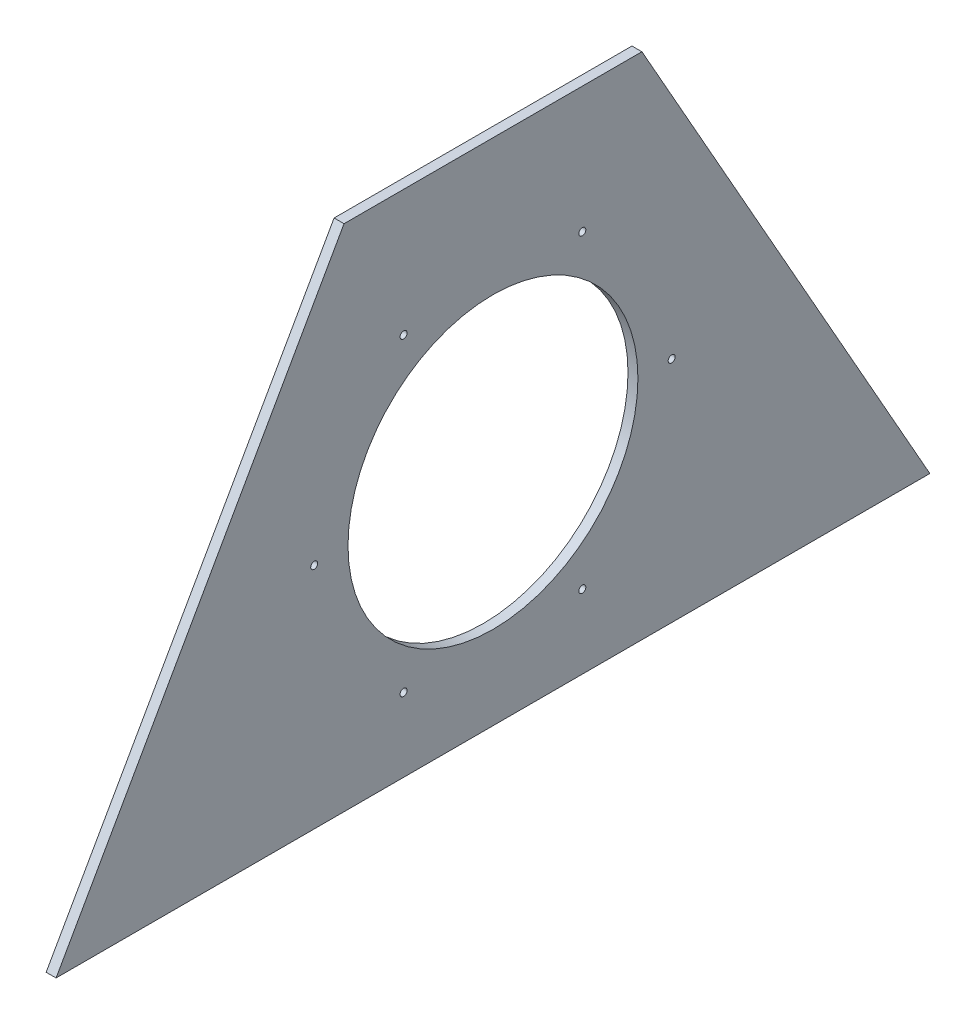
ISO-10303-21;
HEADER;
FILE_DESCRIPTION(('STEP AP214'),'2;1');
FILE_NAME('part.step','',(''),(''),'','','');
FILE_SCHEMA(('AUTOMOTIVE_DESIGN { 1 0 10303 214 1 1 1 1 }'));
ENDSEC;
DATA;
#1=APPLICATION_CONTEXT('core data for automotive mechanical design processes');
#2=APPLICATION_PROTOCOL_DEFINITION('international standard','automotive_design',2000,#1);
#3=PRODUCT_CONTEXT('',#1,'mechanical');
#4=PRODUCT('Part','Part','',(#3));
#5=PRODUCT_RELATED_PRODUCT_CATEGORY('part','',(#4));
#6=PRODUCT_DEFINITION_FORMATION('','',#4);
#7=PRODUCT_DEFINITION_CONTEXT('part definition',#1,'design');
#8=PRODUCT_DEFINITION('design','',#6,#7);
#9=PRODUCT_DEFINITION_SHAPE('','',#8);
#10=(LENGTH_UNIT() NAMED_UNIT(*) SI_UNIT(.MILLI.,.METRE.));
#11=(NAMED_UNIT(*) PLANE_ANGLE_UNIT() SI_UNIT($,.RADIAN.));
#12=(NAMED_UNIT(*) SI_UNIT($,.STERADIAN.) SOLID_ANGLE_UNIT());
#13=UNCERTAINTY_MEASURE_WITH_UNIT(LENGTH_MEASURE(1.E-05),#10,'distance_accuracy_value','');
#14=(GEOMETRIC_REPRESENTATION_CONTEXT(3) GLOBAL_UNCERTAINTY_ASSIGNED_CONTEXT((#13)) GLOBAL_UNIT_ASSIGNED_CONTEXT((#10,
#11,#12)) REPRESENTATION_CONTEXT('',''));
#15=CARTESIAN_POINT('',(0.,0.,0.));
#16=DIRECTION('',(0.,0.,1.));
#17=DIRECTION('',(1.,0.,0.));
#18=AXIS2_PLACEMENT_3D('',#15,#16,#17);
#19=CARTESIAN_POINT('',(6.35,0.,0.));
#20=DIRECTION('',(0.,-0.492192803801765,-0.870486211197947));
#21=DIRECTION('',(0.,0.870486211197947,-0.492192803801765));
#22=AXIS2_PLACEMENT_3D('',#19,#20,#21);
#23=PLANE('',#22);
#24=DIRECTION('',(0.,-0.870486211197947,0.492192803801765));
#25=VECTOR('',#24,1.);
#26=CARTESIAN_POINT('',(0.,0.,0.));
#27=LINE('',#26,#25);
#28=CARTESIAN_POINT('',(0.,325.685452030022,-184.15));
#29=VERTEX_POINT('',#28);
#30=CARTESIAN_POINT('',(0.,0.,0.));
#31=VERTEX_POINT('',#30);
#32=EDGE_CURVE('E98',#29,#31,#27,.T.);
#33=ORIENTED_EDGE('',*,*,#32,.T.);
#34=DIRECTION('',(-1.,0.,0.));
#35=VECTOR('',#34,1.);
#36=CARTESIAN_POINT('',(6.35,0.,0.));
#37=LINE('',#36,#35);
#38=CARTESIAN_POINT('',(6.35,0.,0.));
#39=VERTEX_POINT('',#38);
#40=EDGE_CURVE('E11',#39,#31,#37,.T.);
#41=ORIENTED_EDGE('',*,*,#40,.F.);
#42=DIRECTION('',(0.,-0.870486211197947,0.492192803801765));
#43=VECTOR('',#42,1.);
#44=CARTESIAN_POINT('',(6.35,0.,0.));
#45=LINE('',#44,#43);
#46=CARTESIAN_POINT('',(6.35,325.685452030022,-184.15));
#47=VERTEX_POINT('',#46);
#48=EDGE_CURVE('E85',#47,#39,#45,.T.);
#49=ORIENTED_EDGE('',*,*,#48,.F.);
#50=DIRECTION('',(-1.,0.,0.));
#51=VECTOR('',#50,1.);
#52=CARTESIAN_POINT('',(6.35,325.685452030022,-184.15));
#53=LINE('',#52,#51);
#54=EDGE_CURVE('E94',#47,#29,#53,.T.);
#55=ORIENTED_EDGE('',*,*,#54,.T.);
#56=EDGE_LOOP('',(#33,#41,#49,#55));
#57=FACE_BOUND('',#56,.T.);
#58=ADVANCED_FACE('F33',(#57),#23,.F.);
#59=CARTESIAN_POINT('',(6.35,0.,0.));
#60=DIRECTION('',(0.,1.,0.));
#61=DIRECTION('',(0.,0.,1.));
#62=AXIS2_PLACEMENT_3D('',#59,#60,#61);
#63=PLANE('',#62);
#64=DIRECTION('',(0.,0.,-1.));
#65=VECTOR('',#64,1.);
#66=CARTESIAN_POINT('',(0.,0.,0.));
#67=LINE('',#66,#65);
#68=CARTESIAN_POINT('',(0.,0.,-558.8));
#69=VERTEX_POINT('',#68);
#70=EDGE_CURVE('E89',#31,#69,#67,.T.);
#71=ORIENTED_EDGE('',*,*,#70,.T.);
#72=DIRECTION('',(-1.,0.,0.));
#73=VECTOR('',#72,1.);
#74=CARTESIAN_POINT('',(6.35,0.,-558.8));
#75=LINE('',#74,#73);
#76=CARTESIAN_POINT('',(6.35,0.,-558.8));
#77=VERTEX_POINT('',#76);
#78=EDGE_CURVE('E42',#77,#69,#75,.T.);
#79=ORIENTED_EDGE('',*,*,#78,.F.);
#80=DIRECTION('',(0.,0.,-1.));
#81=VECTOR('',#80,1.);
#82=CARTESIAN_POINT('',(6.35,0.,0.));
#83=LINE('',#82,#81);
#84=EDGE_CURVE('E80',#39,#77,#83,.T.);
#85=ORIENTED_EDGE('',*,*,#84,.F.);
#86=ORIENTED_EDGE('',*,*,#40,.T.);
#87=EDGE_LOOP('',(#71,#79,#85,#86));
#88=FACE_BOUND('',#87,.T.);
#89=ADVANCED_FACE('F88',(#88),#63,.F.);
#90=CARTESIAN_POINT('',(6.35,0.,-558.8));
#91=DIRECTION('',(0.,-0.492192803801765,0.870486211197947));
#92=DIRECTION('',(0.,-0.870486211197947,-0.492192803801765));
#93=AXIS2_PLACEMENT_3D('',#90,#91,#92);
#94=PLANE('',#93);
#95=DIRECTION('',(0.,0.870486211197947,0.492192803801765));
#96=VECTOR('',#95,1.);
#97=CARTESIAN_POINT('',(0.,0.,-558.8));
#98=LINE('',#97,#96);
#99=CARTESIAN_POINT('',(0.,325.685452030022,-374.65));
#100=VERTEX_POINT('',#99);
#101=EDGE_CURVE('E67',#69,#100,#98,.T.);
#102=ORIENTED_EDGE('',*,*,#101,.T.);
#103=DIRECTION('',(-1.,0.,0.));
#104=VECTOR('',#103,1.);
#105=CARTESIAN_POINT('',(6.35,325.685452030022,-374.65));
#106=LINE('',#105,#104);
#107=CARTESIAN_POINT('',(6.35,325.685452030022,-374.65));
#108=VERTEX_POINT('',#107);
#109=EDGE_CURVE('E90',#108,#100,#106,.T.);
#110=ORIENTED_EDGE('',*,*,#109,.F.);
#111=DIRECTION('',(0.,0.870486211197947,0.492192803801765));
#112=VECTOR('',#111,1.);
#113=CARTESIAN_POINT('',(6.35,0.,-558.8));
#114=LINE('',#113,#112);
#115=EDGE_CURVE('E83',#77,#108,#114,.T.);
#116=ORIENTED_EDGE('',*,*,#115,.F.);
#117=ORIENTED_EDGE('',*,*,#78,.T.);
#118=EDGE_LOOP('',(#102,#110,#116,#117));
#119=FACE_BOUND('',#118,.T.);
#120=ADVANCED_FACE('F92',(#119),#94,.F.);
#121=CARTESIAN_POINT('',(6.35,325.685452030022,-184.15));
#122=DIRECTION('',(0.,-1.,0.));
#123=DIRECTION('',(0.,0.,-1.));
#124=AXIS2_PLACEMENT_3D('',#121,#122,#123);
#125=PLANE('',#124);
#126=DIRECTION('',(0.,0.,1.));
#127=VECTOR('',#126,1.);
#128=CARTESIAN_POINT('',(0.,325.685452030022,-184.15));
#129=LINE('',#128,#127);
#130=EDGE_CURVE('E73',#100,#29,#129,.T.);
#131=ORIENTED_EDGE('',*,*,#130,.T.);
#132=ORIENTED_EDGE('',*,*,#54,.F.);
#133=DIRECTION('',(0.,0.,1.));
#134=VECTOR('',#133,1.);
#135=CARTESIAN_POINT('',(6.35,325.685452030022,-184.15));
#136=LINE('',#135,#134);
#137=EDGE_CURVE('E50',#108,#47,#136,.T.);
#138=ORIENTED_EDGE('',*,*,#137,.F.);
#139=ORIENTED_EDGE('',*,*,#109,.T.);
#140=EDGE_LOOP('',(#131,#132,#138,#139));
#141=FACE_BOUND('',#140,.T.);
#142=ADVANCED_FACE('F106',(#141),#125,.F.);
#143=CARTESIAN_POINT('',(6.35,0.,0.));
#144=DIRECTION('',(-1.,0.,0.));
#145=DIRECTION('',(0.,0.,1.));
#146=AXIS2_PLACEMENT_3D('',#143,#144,#145);
#147=PLANE('',#146);
#148=CARTESIAN_POINT('',(6.35,245.036703652561,-222.25));
#149=DIRECTION('',(-1.,0.,0.));
#150=DIRECTION('',(0.,0.,1.));
#151=AXIS2_PLACEMENT_3D('',#148,#149,#150);
#152=CIRCLE('',#151,2.2479);
#153=CARTESIAN_POINT('',(6.35,245.036703652561,-220.0021));
#154=VERTEX_POINT('',#153);
#155=EDGE_CURVE('E144',#154,#154,#152,.T.);
#156=ORIENTED_EDGE('',*,*,#155,.T.);
#157=EDGE_LOOP('',(#156));
#158=FACE_BOUND('',#157,.T.);
#159=CARTESIAN_POINT('',(6.35,146.05,-165.1));
#160=DIRECTION('',(-1.,0.,0.));
#161=DIRECTION('',(0.,0.,1.));
#162=AXIS2_PLACEMENT_3D('',#159,#160,#161);
#163=CIRCLE('',#162,2.2479);
#164=CARTESIAN_POINT('',(6.35,146.05,-162.8521));
#165=VERTEX_POINT('',#164);
#166=EDGE_CURVE('E138',#165,#165,#163,.T.);
#167=ORIENTED_EDGE('',*,*,#166,.T.);
#168=EDGE_LOOP('',(#167));
#169=FACE_BOUND('',#168,.T.);
#170=CARTESIAN_POINT('',(6.35,47.0632963474386,-222.25));
#171=DIRECTION('',(-1.,0.,0.));
#172=DIRECTION('',(0.,0.,1.));
#173=AXIS2_PLACEMENT_3D('',#170,#171,#172);
#174=CIRCLE('',#173,2.2479);
#175=CARTESIAN_POINT('',(6.35,47.0632963474386,-220.0021));
#176=VERTEX_POINT('',#175);
#177=EDGE_CURVE('E36',#176,#176,#174,.T.);
#178=ORIENTED_EDGE('',*,*,#177,.T.);
#179=EDGE_LOOP('',(#178));
#180=FACE_BOUND('',#179,.T.);
#181=CARTESIAN_POINT('',(6.35,47.0632963474386,-336.55));
#182=DIRECTION('',(-1.,0.,0.));
#183=DIRECTION('',(0.,0.,1.));
#184=AXIS2_PLACEMENT_3D('',#181,#182,#183);
#185=CIRCLE('',#184,2.2479);
#186=CARTESIAN_POINT('',(6.35,47.0632963474386,-334.3021));
#187=VERTEX_POINT('',#186);
#188=EDGE_CURVE('E129',#187,#187,#185,.T.);
#189=ORIENTED_EDGE('',*,*,#188,.T.);
#190=EDGE_LOOP('',(#189));
#191=FACE_BOUND('',#190,.T.);
#192=CARTESIAN_POINT('',(6.35,146.05,-393.7));
#193=DIRECTION('',(-1.,0.,0.));
#194=DIRECTION('',(0.,0.,1.));
#195=AXIS2_PLACEMENT_3D('',#192,#193,#194);
#196=CIRCLE('',#195,2.2479);
#197=CARTESIAN_POINT('',(6.35,146.05,-391.4521));
#198=VERTEX_POINT('',#197);
#199=EDGE_CURVE('E123',#198,#198,#196,.T.);
#200=ORIENTED_EDGE('',*,*,#199,.T.);
#201=EDGE_LOOP('',(#200));
#202=FACE_BOUND('',#201,.T.);
#203=CARTESIAN_POINT('',(6.35,245.036703652561,-336.55));
#204=DIRECTION('',(-1.,0.,0.));
#205=DIRECTION('',(0.,0.,1.));
#206=AXIS2_PLACEMENT_3D('',#203,#204,#205);
#207=CIRCLE('',#206,2.2479);
#208=CARTESIAN_POINT('',(6.35,245.036703652561,-334.3021));
#209=VERTEX_POINT('',#208);
#210=EDGE_CURVE('E115',#209,#209,#207,.T.);
#211=ORIENTED_EDGE('',*,*,#210,.T.);
#212=EDGE_LOOP('',(#211));
#213=FACE_BOUND('',#212,.T.);
#214=CARTESIAN_POINT('',(6.35,146.05,-279.4));
#215=DIRECTION('',(1.,0.,0.));
#216=DIRECTION('',(0.,0.,-1.));
#217=AXIS2_PLACEMENT_3D('',#214,#215,#216);
#218=CIRCLE('',#217,92.71);
#219=CARTESIAN_POINT('',(6.35,146.05,-372.11));
#220=VERTEX_POINT('',#219);
#221=EDGE_CURVE('E112',#220,#220,#218,.T.);
#222=ORIENTED_EDGE('',*,*,#221,.F.);
#223=EDGE_LOOP('',(#222));
#224=FACE_BOUND('',#223,.T.);
#225=ORIENTED_EDGE('',*,*,#48,.T.);
#226=ORIENTED_EDGE('',*,*,#84,.T.);
#227=ORIENTED_EDGE('',*,*,#115,.T.);
#228=ORIENTED_EDGE('',*,*,#137,.T.);
#229=EDGE_LOOP('',(#225,#226,#227,#228));
#230=FACE_BOUND('',#229,.T.);
#231=ADVANCED_FACE('F81',(#158,#169,#180,#191,#202,#213,#224,#230),#147,.F.);
#232=CARTESIAN_POINT('',(0.,0.,0.));
#233=DIRECTION('',(-1.,0.,0.));
#234=DIRECTION('',(0.,0.,1.));
#235=AXIS2_PLACEMENT_3D('',#232,#233,#234);
#236=PLANE('',#235);
#237=CARTESIAN_POINT('',(0.,245.036703652561,-222.25));
#238=DIRECTION('',(-1.,0.,0.));
#239=DIRECTION('',(0.,0.,1.));
#240=AXIS2_PLACEMENT_3D('',#237,#238,#239);
#241=CIRCLE('',#240,2.2479);
#242=CARTESIAN_POINT('',(0.,245.036703652561,-220.0021));
#243=VERTEX_POINT('',#242);
#244=EDGE_CURVE('E147',#243,#243,#241,.T.);
#245=ORIENTED_EDGE('',*,*,#244,.F.);
#246=EDGE_LOOP('',(#245));
#247=FACE_BOUND('',#246,.T.);
#248=CARTESIAN_POINT('',(0.,146.05,-165.1));
#249=DIRECTION('',(-1.,0.,0.));
#250=DIRECTION('',(0.,0.,1.));
#251=AXIS2_PLACEMENT_3D('',#248,#249,#250);
#252=CIRCLE('',#251,2.2479);
#253=CARTESIAN_POINT('',(0.,146.05,-162.8521));
#254=VERTEX_POINT('',#253);
#255=EDGE_CURVE('E141',#254,#254,#252,.T.);
#256=ORIENTED_EDGE('',*,*,#255,.F.);
#257=EDGE_LOOP('',(#256));
#258=FACE_BOUND('',#257,.T.);
#259=CARTESIAN_POINT('',(0.,47.0632963474386,-222.25));
#260=DIRECTION('',(-1.,0.,0.));
#261=DIRECTION('',(0.,0.,1.));
#262=AXIS2_PLACEMENT_3D('',#259,#260,#261);
#263=CIRCLE('',#262,2.2479);
#264=CARTESIAN_POINT('',(0.,47.0632963474386,-220.0021));
#265=VERTEX_POINT('',#264);
#266=EDGE_CURVE('E135',#265,#265,#263,.T.);
#267=ORIENTED_EDGE('',*,*,#266,.F.);
#268=EDGE_LOOP('',(#267));
#269=FACE_BOUND('',#268,.T.);
#270=CARTESIAN_POINT('',(0.,47.0632963474386,-336.55));
#271=DIRECTION('',(-1.,0.,0.));
#272=DIRECTION('',(0.,0.,1.));
#273=AXIS2_PLACEMENT_3D('',#270,#271,#272);
#274=CIRCLE('',#273,2.2479);
#275=CARTESIAN_POINT('',(0.,47.0632963474386,-334.3021));
#276=VERTEX_POINT('',#275);
#277=EDGE_CURVE('E132',#276,#276,#274,.T.);
#278=ORIENTED_EDGE('',*,*,#277,.F.);
#279=EDGE_LOOP('',(#278));
#280=FACE_BOUND('',#279,.T.);
#281=CARTESIAN_POINT('',(0.,146.05,-393.7));
#282=DIRECTION('',(-1.,0.,0.));
#283=DIRECTION('',(0.,0.,1.));
#284=AXIS2_PLACEMENT_3D('',#281,#282,#283);
#285=CIRCLE('',#284,2.2479);
#286=CARTESIAN_POINT('',(0.,146.05,-391.4521));
#287=VERTEX_POINT('',#286);
#288=EDGE_CURVE('E126',#287,#287,#285,.T.);
#289=ORIENTED_EDGE('',*,*,#288,.F.);
#290=EDGE_LOOP('',(#289));
#291=FACE_BOUND('',#290,.T.);
#292=CARTESIAN_POINT('',(0.,245.036703652561,-336.55));
#293=DIRECTION('',(-1.,0.,0.));
#294=DIRECTION('',(0.,0.,1.));
#295=AXIS2_PLACEMENT_3D('',#292,#293,#294);
#296=CIRCLE('',#295,2.2479);
#297=CARTESIAN_POINT('',(0.,245.036703652561,-334.3021));
#298=VERTEX_POINT('',#297);
#299=EDGE_CURVE('E120',#298,#298,#296,.T.);
#300=ORIENTED_EDGE('',*,*,#299,.F.);
#301=EDGE_LOOP('',(#300));
#302=FACE_BOUND('',#301,.T.);
#303=CARTESIAN_POINT('',(0.,146.05,-279.4));
#304=DIRECTION('',(1.,0.,0.));
#305=DIRECTION('',(0.,0.,-1.));
#306=AXIS2_PLACEMENT_3D('',#303,#304,#305);
#307=CIRCLE('',#306,92.71);
#308=CARTESIAN_POINT('',(0.,146.05,-372.11));
#309=VERTEX_POINT('',#308);
#310=EDGE_CURVE('E101',#309,#309,#307,.T.);
#311=ORIENTED_EDGE('',*,*,#310,.T.);
#312=EDGE_LOOP('',(#311));
#313=FACE_BOUND('',#312,.T.);
#314=ORIENTED_EDGE('',*,*,#32,.F.);
#315=ORIENTED_EDGE('',*,*,#130,.F.);
#316=ORIENTED_EDGE('',*,*,#101,.F.);
#317=ORIENTED_EDGE('',*,*,#70,.F.);
#318=EDGE_LOOP('',(#314,#315,#316,#317));
#319=FACE_BOUND('',#318,.T.);
#320=ADVANCED_FACE('F109',(#247,#258,#269,#280,#291,#302,#313,#319),#236,.T.);
#321=CARTESIAN_POINT('',(0.,146.05,-279.4));
#322=DIRECTION('',(1.,0.,0.));
#323=DIRECTION('',(0.,0.,-1.));
#324=AXIS2_PLACEMENT_3D('',#321,#322,#323);
#325=CYLINDRICAL_SURFACE('',#324,92.71);
#326=ORIENTED_EDGE('',*,*,#310,.F.);
#327=EDGE_LOOP('',(#326));
#328=FACE_BOUND('',#327,.T.);
#329=ORIENTED_EDGE('',*,*,#221,.T.);
#330=EDGE_LOOP('',(#329));
#331=FACE_BOUND('',#330,.T.);
#332=ADVANCED_FACE('F156',(#328,#331),#325,.F.);
#333=CARTESIAN_POINT('',(0.,245.036703652561,-336.55));
#334=DIRECTION('',(-1.,0.,0.));
#335=DIRECTION('',(0.,0.,1.));
#336=AXIS2_PLACEMENT_3D('',#333,#334,#335);
#337=CYLINDRICAL_SURFACE('',#336,2.2479);
#338=ORIENTED_EDGE('',*,*,#299,.T.);
#339=EDGE_LOOP('',(#338));
#340=FACE_BOUND('',#339,.T.);
#341=ORIENTED_EDGE('',*,*,#210,.F.);
#342=EDGE_LOOP('',(#341));
#343=FACE_BOUND('',#342,.T.);
#344=ADVANCED_FACE('F172',(#340,#343),#337,.F.);
#345=CARTESIAN_POINT('',(0.,146.05,-393.7));
#346=DIRECTION('',(-1.,0.,0.));
#347=DIRECTION('',(0.,0.,1.));
#348=AXIS2_PLACEMENT_3D('',#345,#346,#347);
#349=CYLINDRICAL_SURFACE('',#348,2.2479);
#350=ORIENTED_EDGE('',*,*,#288,.T.);
#351=EDGE_LOOP('',(#350));
#352=FACE_BOUND('',#351,.T.);
#353=ORIENTED_EDGE('',*,*,#199,.F.);
#354=EDGE_LOOP('',(#353));
#355=FACE_BOUND('',#354,.T.);
#356=ADVANCED_FACE('F223',(#352,#355),#349,.F.);
#357=CARTESIAN_POINT('',(0.,47.0632963474386,-336.55));
#358=DIRECTION('',(-1.,0.,0.));
#359=DIRECTION('',(0.,0.,1.));
#360=AXIS2_PLACEMENT_3D('',#357,#358,#359);
#361=CYLINDRICAL_SURFACE('',#360,2.2479);
#362=ORIENTED_EDGE('',*,*,#277,.T.);
#363=EDGE_LOOP('',(#362));
#364=FACE_BOUND('',#363,.T.);
#365=ORIENTED_EDGE('',*,*,#188,.F.);
#366=EDGE_LOOP('',(#365));
#367=FACE_BOUND('',#366,.T.);
#368=ADVANCED_FACE('F233',(#364,#367),#361,.F.);
#369=CARTESIAN_POINT('',(0.,47.0632963474386,-222.25));
#370=DIRECTION('',(-1.,0.,0.));
#371=DIRECTION('',(0.,0.,1.));
#372=AXIS2_PLACEMENT_3D('',#369,#370,#371);
#373=CYLINDRICAL_SURFACE('',#372,2.2479);
#374=ORIENTED_EDGE('',*,*,#266,.T.);
#375=EDGE_LOOP('',(#374));
#376=FACE_BOUND('',#375,.T.);
#377=ORIENTED_EDGE('',*,*,#177,.F.);
#378=EDGE_LOOP('',(#377));
#379=FACE_BOUND('',#378,.T.);
#380=ADVANCED_FACE('F243',(#376,#379),#373,.F.);
#381=CARTESIAN_POINT('',(0.,146.05,-165.1));
#382=DIRECTION('',(-1.,0.,0.));
#383=DIRECTION('',(0.,0.,1.));
#384=AXIS2_PLACEMENT_3D('',#381,#382,#383);
#385=CYLINDRICAL_SURFACE('',#384,2.2479);
#386=ORIENTED_EDGE('',*,*,#255,.T.);
#387=EDGE_LOOP('',(#386));
#388=FACE_BOUND('',#387,.T.);
#389=ORIENTED_EDGE('',*,*,#166,.F.);
#390=EDGE_LOOP('',(#389));
#391=FACE_BOUND('',#390,.T.);
#392=ADVANCED_FACE('F253',(#388,#391),#385,.F.);
#393=CARTESIAN_POINT('',(0.,245.036703652561,-222.25));
#394=DIRECTION('',(-1.,0.,0.));
#395=DIRECTION('',(0.,0.,1.));
#396=AXIS2_PLACEMENT_3D('',#393,#394,#395);
#397=CYLINDRICAL_SURFACE('',#396,2.2479);
#398=ORIENTED_EDGE('',*,*,#244,.T.);
#399=EDGE_LOOP('',(#398));
#400=FACE_BOUND('',#399,.T.);
#401=ORIENTED_EDGE('',*,*,#155,.F.);
#402=EDGE_LOOP('',(#401));
#403=FACE_BOUND('',#402,.T.);
#404=ADVANCED_FACE('F151',(#400,#403),#397,.F.);
#405=CLOSED_SHELL('',(#58,#89,#120,#142,#231,#320,#332,#344,#356,#368,#380,#392,#404));
#406=MANIFOLD_SOLID_BREP('B2',#405);
#407=ADVANCED_BREP_SHAPE_REPRESENTATION('',(#18,#406),#14);
#408=SHAPE_DEFINITION_REPRESENTATION(#9,#407);
ENDSEC;
END-ISO-10303-21;
